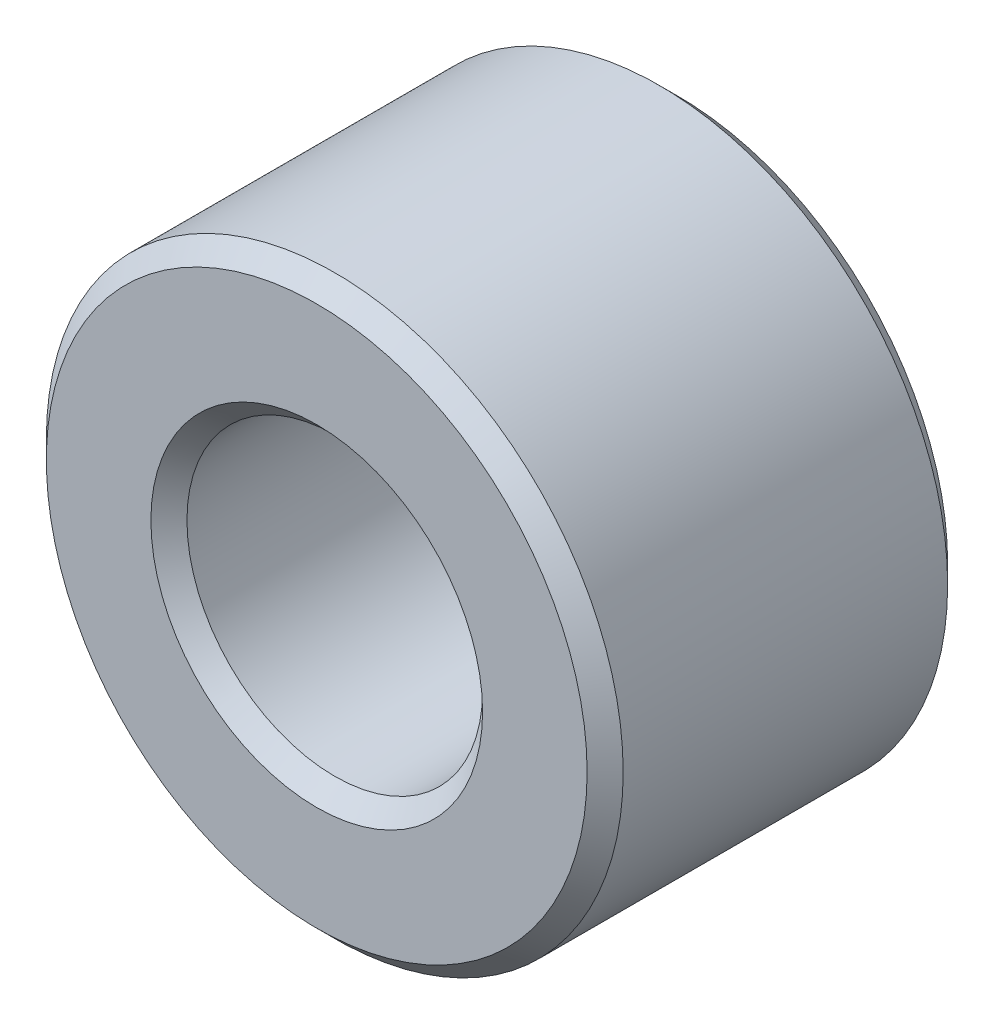
ISO-10303-21;
HEADER;
FILE_DESCRIPTION(('STEP AP214'),'2;1');
FILE_NAME('part.step','',(''),(''),'','','');
FILE_SCHEMA(('AUTOMOTIVE_DESIGN { 1 0 10303 214 1 1 1 1 }'));
ENDSEC;
DATA;
#1=APPLICATION_CONTEXT('core data for automotive mechanical design processes');
#2=APPLICATION_PROTOCOL_DEFINITION('international standard','automotive_design',2000,#1);
#3=PRODUCT_CONTEXT('',#1,'mechanical');
#4=PRODUCT('Part','Part','',(#3));
#5=PRODUCT_RELATED_PRODUCT_CATEGORY('part','',(#4));
#6=PRODUCT_DEFINITION_FORMATION('','',#4);
#7=PRODUCT_DEFINITION_CONTEXT('part definition',#1,'design');
#8=PRODUCT_DEFINITION('design','',#6,#7);
#9=PRODUCT_DEFINITION_SHAPE('','',#8);
#10=(LENGTH_UNIT() NAMED_UNIT(*) SI_UNIT(.MILLI.,.METRE.));
#11=(NAMED_UNIT(*) PLANE_ANGLE_UNIT() SI_UNIT($,.RADIAN.));
#12=(NAMED_UNIT(*) SI_UNIT($,.STERADIAN.) SOLID_ANGLE_UNIT());
#13=UNCERTAINTY_MEASURE_WITH_UNIT(LENGTH_MEASURE(1.E-05),#10,'distance_accuracy_value','');
#14=(GEOMETRIC_REPRESENTATION_CONTEXT(3) GLOBAL_UNCERTAINTY_ASSIGNED_CONTEXT((#13)) GLOBAL_UNIT_ASSIGNED_CONTEXT((#10,
#11,#12)) REPRESENTATION_CONTEXT('',''));
#15=CARTESIAN_POINT('',(0.,0.,0.));
#16=DIRECTION('',(0.,0.,1.));
#17=DIRECTION('',(1.,0.,0.));
#18=AXIS2_PLACEMENT_3D('',#15,#16,#17);
#19=CARTESIAN_POINT('',(0.,0.,5.));
#20=DIRECTION('',(0.,0.,1.));
#21=DIRECTION('',(1.,0.,0.));
#22=AXIS2_PLACEMENT_3D('',#19,#20,#21);
#23=PLANE('',#22);
#24=CARTESIAN_POINT('',(0.,0.,5.));
#25=DIRECTION('',(0.,0.,1.));
#26=DIRECTION('',(1.,0.,0.));
#27=AXIS2_PLACEMENT_3D('',#24,#25,#26);
#28=CIRCLE('',#27,3.75);
#29=CARTESIAN_POINT('',(3.75,0.,5.));
#30=VERTEX_POINT('',#29);
#31=EDGE_CURVE('E10',#30,#30,#28,.T.);
#32=ORIENTED_EDGE('',*,*,#31,.T.);
#33=EDGE_LOOP('',(#32));
#34=FACE_BOUND('',#33,.T.);
#35=CARTESIAN_POINT('',(0.,0.,5.));
#36=DIRECTION('',(0.,0.,1.));
#37=DIRECTION('',(1.,0.,0.));
#38=AXIS2_PLACEMENT_3D('',#35,#36,#37);
#39=CIRCLE('',#38,2.3);
#40=CARTESIAN_POINT('',(2.3,0.,5.));
#41=VERTEX_POINT('',#40);
#42=EDGE_CURVE('E35',#41,#41,#39,.F.);
#43=ORIENTED_EDGE('',*,*,#42,.T.);
#44=EDGE_LOOP('',(#43));
#45=FACE_BOUND('',#44,.T.);
#46=ADVANCED_FACE('F28',(#34,#45),#23,.T.);
#47=CARTESIAN_POINT('',(0.,0.,0.));
#48=DIRECTION('',(0.,0.,1.));
#49=DIRECTION('',(1.,0.,0.));
#50=AXIS2_PLACEMENT_3D('',#47,#48,#49);
#51=PLANE('',#50);
#52=CARTESIAN_POINT('',(0.,0.,0.));
#53=DIRECTION('',(0.,0.,1.));
#54=DIRECTION('',(1.,0.,0.));
#55=AXIS2_PLACEMENT_3D('',#52,#53,#54);
#56=CIRCLE('',#55,3.75);
#57=CARTESIAN_POINT('',(3.75,0.,0.));
#58=VERTEX_POINT('',#57);
#59=EDGE_CURVE('E48',#58,#58,#56,.F.);
#60=ORIENTED_EDGE('',*,*,#59,.T.);
#61=EDGE_LOOP('',(#60));
#62=FACE_BOUND('',#61,.T.);
#63=CARTESIAN_POINT('',(0.,0.,0.));
#64=DIRECTION('',(0.,0.,1.));
#65=DIRECTION('',(1.,0.,0.));
#66=AXIS2_PLACEMENT_3D('',#63,#64,#65);
#67=CIRCLE('',#66,2.3);
#68=CARTESIAN_POINT('',(2.3,0.,0.));
#69=VERTEX_POINT('',#68);
#70=EDGE_CURVE('E51',#69,#69,#67,.T.);
#71=ORIENTED_EDGE('',*,*,#70,.T.);
#72=EDGE_LOOP('',(#71));
#73=FACE_BOUND('',#72,.T.);
#74=ADVANCED_FACE('F76',(#62,#73),#51,.F.);
#75=CARTESIAN_POINT('',(0.,0.,5.));
#76=DIRECTION('',(0.,0.,-1.));
#77=DIRECTION('',(-1.,0.,0.));
#78=AXIS2_PLACEMENT_3D('',#75,#76,#77);
#79=CYLINDRICAL_SURFACE('',#78,4.);
#80=CARTESIAN_POINT('',(0.,0.,0.250000000000003));
#81=DIRECTION('',(0.,0.,1.));
#82=DIRECTION('',(1.,0.,0.));
#83=AXIS2_PLACEMENT_3D('',#80,#81,#82);
#84=CIRCLE('',#83,4.);
#85=CARTESIAN_POINT('',(4.,0.,0.250000000000003));
#86=VERTEX_POINT('',#85);
#87=EDGE_CURVE('E54',#86,#86,#84,.T.);
#88=ORIENTED_EDGE('',*,*,#87,.T.);
#89=EDGE_LOOP('',(#88));
#90=FACE_BOUND('',#89,.T.);
#91=CARTESIAN_POINT('',(0.,0.,4.75));
#92=DIRECTION('',(0.,0.,1.));
#93=DIRECTION('',(1.,0.,0.));
#94=AXIS2_PLACEMENT_3D('',#91,#92,#93);
#95=CIRCLE('',#94,4.);
#96=CARTESIAN_POINT('',(4.,0.,4.75));
#97=VERTEX_POINT('',#96);
#98=EDGE_CURVE('E57',#97,#97,#95,.F.);
#99=ORIENTED_EDGE('',*,*,#98,.T.);
#100=EDGE_LOOP('',(#99));
#101=FACE_BOUND('',#100,.T.);
#102=ADVANCED_FACE('F61',(#90,#101),#79,.T.);
#103=CARTESIAN_POINT('',(0.,0.,5.));
#104=DIRECTION('',(0.,0.,-1.));
#105=DIRECTION('',(-1.,0.,0.));
#106=AXIS2_PLACEMENT_3D('',#103,#104,#105);
#107=CYLINDRICAL_SURFACE('',#106,2.05);
#108=CARTESIAN_POINT('',(0.,0.,0.250000000000003));
#109=DIRECTION('',(0.,0.,1.));
#110=DIRECTION('',(1.,0.,0.));
#111=AXIS2_PLACEMENT_3D('',#108,#109,#110);
#112=CIRCLE('',#111,2.05);
#113=CARTESIAN_POINT('',(2.05,0.,0.250000000000003));
#114=VERTEX_POINT('',#113);
#115=EDGE_CURVE('E39',#114,#114,#112,.F.);
#116=ORIENTED_EDGE('',*,*,#115,.T.);
#117=EDGE_LOOP('',(#116));
#118=FACE_BOUND('',#117,.T.);
#119=CARTESIAN_POINT('',(0.,0.,4.75));
#120=DIRECTION('',(0.,0.,1.));
#121=DIRECTION('',(1.,0.,0.));
#122=AXIS2_PLACEMENT_3D('',#119,#120,#121);
#123=CIRCLE('',#122,2.05);
#124=CARTESIAN_POINT('',(2.05,0.,4.75));
#125=VERTEX_POINT('',#124);
#126=EDGE_CURVE('E43',#125,#125,#123,.T.);
#127=ORIENTED_EDGE('',*,*,#126,.T.);
#128=EDGE_LOOP('',(#127));
#129=FACE_BOUND('',#128,.T.);
#130=ADVANCED_FACE('F84',(#118,#129),#107,.F.);
#131=CARTESIAN_POINT('',(0.,0.,0.250000000000003));
#132=DIRECTION('',(0.,0.,1.));
#133=DIRECTION('',(1.,0.,0.));
#134=AXIS2_PLACEMENT_3D('',#131,#132,#133);
#135=CONICAL_SURFACE('',#134,4.,0.785398163397448);
#136=ORIENTED_EDGE('',*,*,#59,.F.);
#137=EDGE_LOOP('',(#136));
#138=FACE_BOUND('',#137,.T.);
#139=ORIENTED_EDGE('',*,*,#87,.F.);
#140=EDGE_LOOP('',(#139));
#141=FACE_BOUND('',#140,.T.);
#142=ADVANCED_FACE('F72',(#138,#141),#135,.T.);
#143=CARTESIAN_POINT('',(0.,0.,0.));
#144=DIRECTION('',(0.,0.,-1.));
#145=DIRECTION('',(-1.,0.,0.));
#146=AXIS2_PLACEMENT_3D('',#143,#144,#145);
#147=CONICAL_SURFACE('',#146,2.3,0.785398163397445);
#148=ORIENTED_EDGE('',*,*,#115,.F.);
#149=EDGE_LOOP('',(#148));
#150=FACE_BOUND('',#149,.T.);
#151=ORIENTED_EDGE('',*,*,#70,.F.);
#152=EDGE_LOOP('',(#151));
#153=FACE_BOUND('',#152,.T.);
#154=ADVANCED_FACE('F66',(#150,#153),#147,.F.);
#155=CARTESIAN_POINT('',(0.,0.,5.));
#156=DIRECTION('',(0.,0.,-1.));
#157=DIRECTION('',(-1.,0.,0.));
#158=AXIS2_PLACEMENT_3D('',#155,#156,#157);
#159=CONICAL_SURFACE('',#158,3.75,0.785398163397445);
#160=ORIENTED_EDGE('',*,*,#98,.F.);
#161=EDGE_LOOP('',(#160));
#162=FACE_BOUND('',#161,.T.);
#163=ORIENTED_EDGE('',*,*,#31,.F.);
#164=EDGE_LOOP('',(#163));
#165=FACE_BOUND('',#164,.T.);
#166=ADVANCED_FACE('F63',(#162,#165),#159,.T.);
#167=CARTESIAN_POINT('',(0.,0.,4.75));
#168=DIRECTION('',(0.,0.,1.));
#169=DIRECTION('',(1.,0.,0.));
#170=AXIS2_PLACEMENT_3D('',#167,#168,#169);
#171=CONICAL_SURFACE('',#170,2.05,0.785398163397448);
#172=ORIENTED_EDGE('',*,*,#42,.F.);
#173=EDGE_LOOP('',(#172));
#174=FACE_BOUND('',#173,.T.);
#175=ORIENTED_EDGE('',*,*,#126,.F.);
#176=EDGE_LOOP('',(#175));
#177=FACE_BOUND('',#176,.T.);
#178=ADVANCED_FACE('F30',(#174,#177),#171,.F.);
#179=CLOSED_SHELL('',(#46,#74,#102,#130,#142,#154,#166,#178));
#180=MANIFOLD_SOLID_BREP('B2',#179);
#181=ADVANCED_BREP_SHAPE_REPRESENTATION('',(#18,#180),#14);
#182=SHAPE_DEFINITION_REPRESENTATION(#9,#181);
ENDSEC;
END-ISO-10303-21;
